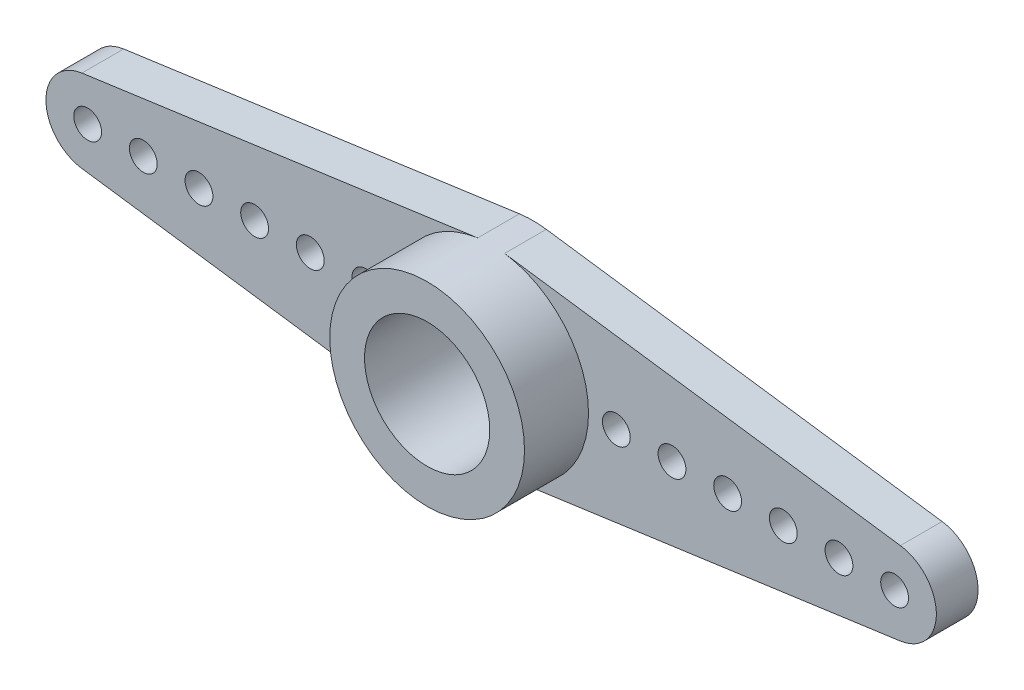
ISO-10303-21;
HEADER;
FILE_DESCRIPTION(('STEP AP214'),'2;1');
FILE_NAME('part.step','',(''),(''),'','','');
FILE_SCHEMA(('AUTOMOTIVE_DESIGN { 1 0 10303 214 1 1 1 1 }'));
ENDSEC;
DATA;
#1=APPLICATION_CONTEXT('core data for automotive mechanical design processes');
#2=APPLICATION_PROTOCOL_DEFINITION('international standard','automotive_design',2000,#1);
#3=PRODUCT_CONTEXT('',#1,'mechanical');
#4=PRODUCT('Part','Part','',(#3));
#5=PRODUCT_RELATED_PRODUCT_CATEGORY('part','',(#4));
#6=PRODUCT_DEFINITION_FORMATION('','',#4);
#7=PRODUCT_DEFINITION_CONTEXT('part definition',#1,'design');
#8=PRODUCT_DEFINITION('design','',#6,#7);
#9=PRODUCT_DEFINITION_SHAPE('','',#8);
#10=(LENGTH_UNIT() NAMED_UNIT(*) SI_UNIT(.MILLI.,.METRE.));
#11=(NAMED_UNIT(*) PLANE_ANGLE_UNIT() SI_UNIT($,.RADIAN.));
#12=(NAMED_UNIT(*) SI_UNIT($,.STERADIAN.) SOLID_ANGLE_UNIT());
#13=UNCERTAINTY_MEASURE_WITH_UNIT(LENGTH_MEASURE(1.E-05),#10,'distance_accuracy_value','');
#14=(GEOMETRIC_REPRESENTATION_CONTEXT(3) GLOBAL_UNCERTAINTY_ASSIGNED_CONTEXT((#13)) GLOBAL_UNIT_ASSIGNED_CONTEXT((#10,
#11,#12)) REPRESENTATION_CONTEXT('',''));
#15=CARTESIAN_POINT('',(0.,0.,0.));
#16=DIRECTION('',(0.,0.,1.));
#17=DIRECTION('',(1.,0.,0.));
#18=AXIS2_PLACEMENT_3D('',#15,#16,#17);
#19=CARTESIAN_POINT('',(-14.5,0.,1.5));
#20=DIRECTION('',(0.,0.,1.));
#21=DIRECTION('',(1.,0.,0.));
#22=AXIS2_PLACEMENT_3D('',#19,#20,#21);
#23=PLANE('',#22);
#24=CARTESIAN_POINT('',(-12.5,0.,1.5));
#25=DIRECTION('',(0.,0.,1.));
#26=DIRECTION('',(1.,0.,0.));
#27=AXIS2_PLACEMENT_3D('',#24,#25,#26);
#28=CIRCLE('',#27,0.499999999999999);
#29=CARTESIAN_POINT('',(-12.,0.,1.5));
#30=VERTEX_POINT('',#29);
#31=EDGE_CURVE('E452',#30,#30,#28,.F.);
#32=ORIENTED_EDGE('',*,*,#31,.T.);
#33=EDGE_LOOP('',(#32));
#34=FACE_BOUND('',#33,.T.);
#35=CARTESIAN_POINT('',(-14.5,0.,1.5));
#36=DIRECTION('',(0.,0.,1.));
#37=DIRECTION('',(1.,0.,0.));
#38=AXIS2_PLACEMENT_3D('',#35,#36,#37);
#39=CIRCLE('',#38,0.500000000000001);
#40=CARTESIAN_POINT('',(-14.,0.,1.5));
#41=VERTEX_POINT('',#40);
#42=EDGE_CURVE('E456',#41,#41,#39,.F.);
#43=ORIENTED_EDGE('',*,*,#42,.T.);
#44=EDGE_LOOP('',(#43));
#45=FACE_BOUND('',#44,.T.);
#46=CARTESIAN_POINT('',(-4.5,0.,1.5));
#47=DIRECTION('',(0.,0.,1.));
#48=DIRECTION('',(1.,0.,0.));
#49=AXIS2_PLACEMENT_3D('',#46,#47,#48);
#50=CIRCLE('',#49,0.5);
#51=CARTESIAN_POINT('',(-4.,0.,1.5));
#52=VERTEX_POINT('',#51);
#53=EDGE_CURVE('E480',#52,#52,#50,.F.);
#54=ORIENTED_EDGE('',*,*,#53,.T.);
#55=EDGE_LOOP('',(#54));
#56=FACE_BOUND('',#55,.T.);
#57=CARTESIAN_POINT('',(-10.5,0.,1.5));
#58=DIRECTION('',(0.,0.,1.));
#59=DIRECTION('',(1.,0.,0.));
#60=AXIS2_PLACEMENT_3D('',#57,#58,#59);
#61=CIRCLE('',#60,0.500000000000001);
#62=CARTESIAN_POINT('',(-10.,0.,1.5));
#63=VERTEX_POINT('',#62);
#64=EDGE_CURVE('E458',#63,#63,#61,.F.);
#65=ORIENTED_EDGE('',*,*,#64,.T.);
#66=EDGE_LOOP('',(#65));
#67=FACE_BOUND('',#66,.T.);
#68=CARTESIAN_POINT('',(-8.5,0.,1.5));
#69=DIRECTION('',(0.,0.,1.));
#70=DIRECTION('',(1.,0.,0.));
#71=AXIS2_PLACEMENT_3D('',#68,#69,#70);
#72=CIRCLE('',#71,0.500000000000001);
#73=CARTESIAN_POINT('',(-8.,0.,1.5));
#74=VERTEX_POINT('',#73);
#75=EDGE_CURVE('E500',#74,#74,#72,.F.);
#76=ORIENTED_EDGE('',*,*,#75,.T.);
#77=EDGE_LOOP('',(#76));
#78=FACE_BOUND('',#77,.T.);
#79=CARTESIAN_POINT('',(-6.5,0.,1.5));
#80=DIRECTION('',(0.,0.,1.));
#81=DIRECTION('',(1.,0.,0.));
#82=AXIS2_PLACEMENT_3D('',#79,#80,#81);
#83=CIRCLE('',#82,0.5);
#84=CARTESIAN_POINT('',(-6.,0.,1.5));
#85=VERTEX_POINT('',#84);
#86=EDGE_CURVE('E503',#85,#85,#83,.F.);
#87=ORIENTED_EDGE('',*,*,#86,.T.);
#88=EDGE_LOOP('',(#87));
#89=FACE_BOUND('',#88,.T.);
#90=CARTESIAN_POINT('',(0.,0.,1.5));
#91=DIRECTION('',(0.,0.,1.));
#92=DIRECTION('',(1.,0.,0.));
#93=AXIS2_PLACEMENT_3D('',#90,#91,#92);
#94=CIRCLE('',#93,3.5);
#95=CARTESIAN_POINT('',(-0.482758620689656,3.46654642463502,1.5));
#96=VERTEX_POINT('',#95);
#97=CARTESIAN_POINT('',(-0.482758620689655,-3.46654642463502,1.5));
#98=VERTEX_POINT('',#97);
#99=EDGE_CURVE('E11',#96,#98,#94,.T.);
#100=ORIENTED_EDGE('',*,*,#99,.F.);
#101=DIRECTION('',(-0.990441835610005,-0.137931034482759,0.));
#102=VECTOR('',#101,1.);
#103=CARTESIAN_POINT('',(-14.7068965517241,1.48566275341501,1.5));
#104=LINE('',#103,#102);
#105=CARTESIAN_POINT('',(-14.7068965517241,1.48566275341501,1.5));
#106=VERTEX_POINT('',#105);
#107=EDGE_CURVE('E56',#96,#106,#104,.T.);
#108=ORIENTED_EDGE('',*,*,#107,.T.);
#109=CARTESIAN_POINT('',(-14.5,0.,1.5));
#110=DIRECTION('',(0.,0.,1.));
#111=DIRECTION('',(1.,0.,0.));
#112=AXIS2_PLACEMENT_3D('',#109,#110,#111);
#113=CIRCLE('',#112,1.5);
#114=CARTESIAN_POINT('',(-14.7068965517241,-1.48566275341501,1.5));
#115=VERTEX_POINT('',#114);
#116=EDGE_CURVE('E158',#106,#115,#113,.T.);
#117=ORIENTED_EDGE('',*,*,#116,.T.);
#118=DIRECTION('',(0.990441835610005,-0.137931034482759,0.));
#119=VECTOR('',#118,1.);
#120=CARTESIAN_POINT('',(-14.7068965517241,-1.48566275341501,1.5));
#121=LINE('',#120,#119);
#122=EDGE_CURVE('E101',#115,#98,#121,.T.);
#123=ORIENTED_EDGE('',*,*,#122,.T.);
#124=EDGE_LOOP('',(#100,#108,#117,#123));
#125=FACE_BOUND('',#124,.T.);
#126=ADVANCED_FACE('F37',(#34,#45,#56,#67,#78,#89,#125),#23,.T.);
#127=CARTESIAN_POINT('',(-14.5,0.,1.5));
#128=DIRECTION('',(0.,0.,-1.));
#129=DIRECTION('',(-1.,0.,0.));
#130=AXIS2_PLACEMENT_3D('',#127,#128,#129);
#131=CYLINDRICAL_SURFACE('',#130,1.5);
#132=CARTESIAN_POINT('',(-14.5,0.,0.));
#133=DIRECTION('',(0.,0.,1.));
#134=DIRECTION('',(1.,0.,0.));
#135=AXIS2_PLACEMENT_3D('',#132,#133,#134);
#136=CIRCLE('',#135,1.5);
#137=CARTESIAN_POINT('',(-14.7068965517241,1.48566275341501,0.));
#138=VERTEX_POINT('',#137);
#139=CARTESIAN_POINT('',(-14.7068965517241,-1.48566275341501,0.));
#140=VERTEX_POINT('',#139);
#141=EDGE_CURVE('E143',#138,#140,#136,.T.);
#142=ORIENTED_EDGE('',*,*,#141,.T.);
#143=DIRECTION('',(0.,0.,-1.));
#144=VECTOR('',#143,1.);
#145=CARTESIAN_POINT('',(-14.7068965517241,-1.48566275341501,1.5));
#146=LINE('',#145,#144);
#147=EDGE_CURVE('E41',#115,#140,#146,.T.);
#148=ORIENTED_EDGE('',*,*,#147,.F.);
#149=ORIENTED_EDGE('',*,*,#116,.F.);
#150=DIRECTION('',(0.,0.,-1.));
#151=VECTOR('',#150,1.);
#152=CARTESIAN_POINT('',(-14.7068965517241,1.48566275341501,1.5));
#153=LINE('',#152,#151);
#154=EDGE_CURVE('E139',#106,#138,#153,.T.);
#155=ORIENTED_EDGE('',*,*,#154,.T.);
#156=EDGE_LOOP('',(#142,#148,#149,#155));
#157=FACE_BOUND('',#156,.T.);
#158=ADVANCED_FACE('F39',(#157),#131,.T.);
#159=CARTESIAN_POINT('',(-14.7068965517241,-1.48566275341501,1.5));
#160=DIRECTION('',(0.137931034482759,0.990441835610005,0.));
#161=DIRECTION('',(-0.990441835610005,0.137931034482759,0.));
#162=AXIS2_PLACEMENT_3D('',#159,#160,#161);
#163=PLANE('',#162);
#164=DIRECTION('',(0.990441835610005,-0.137931034482759,0.));
#165=VECTOR('',#164,1.);
#166=CARTESIAN_POINT('',(-14.7068965517241,-1.48566275341501,0.));
#167=LINE('',#166,#165);
#168=CARTESIAN_POINT('',(-0.482758620689655,-3.46654642463502,0.));
#169=VERTEX_POINT('',#168);
#170=EDGE_CURVE('E146',#140,#169,#167,.T.);
#171=ORIENTED_EDGE('',*,*,#170,.T.);
#172=DIRECTION('',(0.,0.,-1.));
#173=VECTOR('',#172,1.);
#174=CARTESIAN_POINT('',(-0.482758620689655,-3.46654642463502,1.5));
#175=LINE('',#174,#173);
#176=EDGE_CURVE('E166',#98,#169,#175,.T.);
#177=ORIENTED_EDGE('',*,*,#176,.F.);
#178=ORIENTED_EDGE('',*,*,#122,.F.);
#179=ORIENTED_EDGE('',*,*,#147,.T.);
#180=EDGE_LOOP('',(#171,#177,#178,#179));
#181=FACE_BOUND('',#180,.T.);
#182=ADVANCED_FACE('F176',(#181),#163,.F.);
#183=CARTESIAN_POINT('',(14.7068965517241,-1.48566275341501,1.5));
#184=DIRECTION('',(-0.137931034482759,0.990441835610005,0.));
#185=DIRECTION('',(-0.990441835610005,-0.137931034482759,0.));
#186=AXIS2_PLACEMENT_3D('',#183,#184,#185);
#187=PLANE('',#186);
#188=DIRECTION('',(0.990441835610005,0.137931034482759,0.));
#189=VECTOR('',#188,1.);
#190=CARTESIAN_POINT('',(14.7068965517241,-1.48566275341501,0.));
#191=LINE('',#190,#189);
#192=CARTESIAN_POINT('',(0.482758620689655,-3.46654642463502,0.));
#193=VERTEX_POINT('',#192);
#194=CARTESIAN_POINT('',(14.7068965517241,-1.48566275341501,0.));
#195=VERTEX_POINT('',#194);
#196=EDGE_CURVE('E151',#193,#195,#191,.T.);
#197=ORIENTED_EDGE('',*,*,#196,.T.);
#198=DIRECTION('',(0.,0.,-1.));
#199=VECTOR('',#198,1.);
#200=CARTESIAN_POINT('',(14.7068965517241,-1.48566275341501,1.5));
#201=LINE('',#200,#199);
#202=CARTESIAN_POINT('',(14.7068965517241,-1.48566275341501,1.5));
#203=VERTEX_POINT('',#202);
#204=EDGE_CURVE('E133',#203,#195,#201,.T.);
#205=ORIENTED_EDGE('',*,*,#204,.F.);
#206=DIRECTION('',(0.990441835610005,0.137931034482759,0.));
#207=VECTOR('',#206,1.);
#208=CARTESIAN_POINT('',(14.7068965517241,-1.48566275341501,1.5));
#209=LINE('',#208,#207);
#210=CARTESIAN_POINT('',(0.482758620689655,-3.46654642463502,1.5));
#211=VERTEX_POINT('',#210);
#212=EDGE_CURVE('E121',#211,#203,#209,.T.);
#213=ORIENTED_EDGE('',*,*,#212,.F.);
#214=DIRECTION('',(0.,0.,-1.));
#215=VECTOR('',#214,1.);
#216=CARTESIAN_POINT('',(0.482758620689655,-3.46654642463502,1.5));
#217=LINE('',#216,#215);
#218=EDGE_CURVE('E164',#211,#193,#217,.T.);
#219=ORIENTED_EDGE('',*,*,#218,.T.);
#220=EDGE_LOOP('',(#197,#205,#213,#219));
#221=FACE_BOUND('',#220,.T.);
#222=ADVANCED_FACE('F186',(#221),#187,.F.);
#223=CARTESIAN_POINT('',(14.5,0.,1.5));
#224=DIRECTION('',(0.,0.,-1.));
#225=DIRECTION('',(-1.,0.,0.));
#226=AXIS2_PLACEMENT_3D('',#223,#224,#225);
#227=CYLINDRICAL_SURFACE('',#226,1.5);
#228=CARTESIAN_POINT('',(14.5,0.,0.));
#229=DIRECTION('',(0.,0.,1.));
#230=DIRECTION('',(-1.,0.,0.));
#231=AXIS2_PLACEMENT_3D('',#228,#229,#230);
#232=CIRCLE('',#231,1.5);
#233=CARTESIAN_POINT('',(14.7068965517241,1.48566275341501,0.));
#234=VERTEX_POINT('',#233);
#235=EDGE_CURVE('E130',#195,#234,#232,.T.);
#236=ORIENTED_EDGE('',*,*,#235,.T.);
#237=DIRECTION('',(0.,0.,-1.));
#238=VECTOR('',#237,1.);
#239=CARTESIAN_POINT('',(14.7068965517241,1.48566275341501,1.5));
#240=LINE('',#239,#238);
#241=CARTESIAN_POINT('',(14.7068965517241,1.48566275341501,1.5));
#242=VERTEX_POINT('',#241);
#243=EDGE_CURVE('E127',#242,#234,#240,.T.);
#244=ORIENTED_EDGE('',*,*,#243,.F.);
#245=CARTESIAN_POINT('',(14.5,0.,1.5));
#246=DIRECTION('',(0.,0.,1.));
#247=DIRECTION('',(-1.,0.,0.));
#248=AXIS2_PLACEMENT_3D('',#245,#246,#247);
#249=CIRCLE('',#248,1.5);
#250=EDGE_CURVE('E114',#203,#242,#249,.T.);
#251=ORIENTED_EDGE('',*,*,#250,.F.);
#252=ORIENTED_EDGE('',*,*,#204,.T.);
#253=EDGE_LOOP('',(#236,#244,#251,#252));
#254=FACE_BOUND('',#253,.T.);
#255=ADVANCED_FACE('F128',(#254),#227,.T.);
#256=CARTESIAN_POINT('',(14.7068965517241,1.48566275341501,1.5));
#257=DIRECTION('',(-0.137931034482759,-0.990441835610005,0.));
#258=DIRECTION('',(0.990441835610005,-0.137931034482759,0.));
#259=AXIS2_PLACEMENT_3D('',#256,#257,#258);
#260=PLANE('',#259);
#261=DIRECTION('',(-0.990441835610005,0.137931034482759,0.));
#262=VECTOR('',#261,1.);
#263=CARTESIAN_POINT('',(14.7068965517241,1.48566275341501,0.));
#264=LINE('',#263,#262);
#265=CARTESIAN_POINT('',(0.482758620689655,3.46654642463502,0.));
#266=VERTEX_POINT('',#265);
#267=EDGE_CURVE('E154',#234,#266,#264,.T.);
#268=ORIENTED_EDGE('',*,*,#267,.T.);
#269=DIRECTION('',(0.,0.,-1.));
#270=VECTOR('',#269,1.);
#271=CARTESIAN_POINT('',(0.482758620689655,3.46654642463502,1.5));
#272=LINE('',#271,#270);
#273=CARTESIAN_POINT('',(0.482758620689655,3.46654642463502,1.5));
#274=VERTEX_POINT('',#273);
#275=EDGE_CURVE('E134',#274,#266,#272,.T.);
#276=ORIENTED_EDGE('',*,*,#275,.F.);
#277=DIRECTION('',(-0.990441835610005,0.137931034482759,0.));
#278=VECTOR('',#277,1.);
#279=CARTESIAN_POINT('',(14.7068965517241,1.48566275341501,1.5));
#280=LINE('',#279,#278);
#281=EDGE_CURVE('E118',#242,#274,#280,.T.);
#282=ORIENTED_EDGE('',*,*,#281,.F.);
#283=ORIENTED_EDGE('',*,*,#243,.T.);
#284=EDGE_LOOP('',(#268,#276,#282,#283));
#285=FACE_BOUND('',#284,.T.);
#286=ADVANCED_FACE('F137',(#285),#260,.F.);
#287=CARTESIAN_POINT('',(0.,0.,1.5));
#288=DIRECTION('',(0.,0.,-1.));
#289=DIRECTION('',(-1.,0.,0.));
#290=AXIS2_PLACEMENT_3D('',#287,#288,#289);
#291=CYLINDRICAL_SURFACE('',#290,3.5);
#292=CARTESIAN_POINT('',(0.,0.,0.));
#293=DIRECTION('',(0.,0.,1.));
#294=DIRECTION('',(1.,0.,0.));
#295=AXIS2_PLACEMENT_3D('',#292,#293,#294);
#296=CIRCLE('',#295,3.5);
#297=CARTESIAN_POINT('',(-0.482758620689656,3.46654642463502,0.));
#298=VERTEX_POINT('',#297);
#299=EDGE_CURVE('E86',#266,#298,#296,.T.);
#300=ORIENTED_EDGE('',*,*,#299,.T.);
#301=DIRECTION('',(0.,0.,-1.));
#302=VECTOR('',#301,1.);
#303=CARTESIAN_POINT('',(-0.482758620689656,3.46654642463502,1.5));
#304=LINE('',#303,#302);
#305=EDGE_CURVE('E160',#96,#298,#304,.T.);
#306=ORIENTED_EDGE('',*,*,#305,.F.);
#307=ORIENTED_EDGE('',*,*,#99,.T.);
#308=ORIENTED_EDGE('',*,*,#176,.T.);
#309=CARTESIAN_POINT('',(0.,0.,0.));
#310=DIRECTION('',(0.,0.,1.));
#311=DIRECTION('',(1.,0.,0.));
#312=AXIS2_PLACEMENT_3D('',#309,#310,#311);
#313=CIRCLE('',#312,3.5);
#314=EDGE_CURVE('E149',#169,#193,#313,.T.);
#315=ORIENTED_EDGE('',*,*,#314,.T.);
#316=ORIENTED_EDGE('',*,*,#218,.F.);
#317=EDGE_CURVE('E47',#211,#274,#94,.T.);
#318=ORIENTED_EDGE('',*,*,#317,.T.);
#319=ORIENTED_EDGE('',*,*,#275,.T.);
#320=EDGE_LOOP('',(#300,#306,#307,#308,#315,#316,#318,#319));
#321=FACE_BOUND('',#320,.T.);
#322=CARTESIAN_POINT('',(0.,0.,3.8));
#323=DIRECTION('',(0.,0.,1.));
#324=DIRECTION('',(1.,0.,0.));
#325=AXIS2_PLACEMENT_3D('',#322,#323,#324);
#326=CIRCLE('',#325,3.5);
#327=CARTESIAN_POINT('',(3.5,0.,3.8));
#328=VERTEX_POINT('',#327);
#329=EDGE_CURVE('E147',#328,#328,#326,.T.);
#330=ORIENTED_EDGE('',*,*,#329,.F.);
#331=EDGE_LOOP('',(#330));
#332=FACE_BOUND('',#331,.T.);
#333=ADVANCED_FACE('F177',(#321,#332),#291,.T.);
#334=CARTESIAN_POINT('',(-14.7068965517241,1.48566275341501,1.5));
#335=DIRECTION('',(0.137931034482759,-0.990441835610005,0.));
#336=DIRECTION('',(0.990441835610005,0.137931034482759,0.));
#337=AXIS2_PLACEMENT_3D('',#334,#335,#336);
#338=PLANE('',#337);
#339=DIRECTION('',(-0.990441835610005,-0.137931034482759,0.));
#340=VECTOR('',#339,1.);
#341=CARTESIAN_POINT('',(-14.7068965517241,1.48566275341501,0.));
#342=LINE('',#341,#340);
#343=EDGE_CURVE('E92',#298,#138,#342,.T.);
#344=ORIENTED_EDGE('',*,*,#343,.T.);
#345=ORIENTED_EDGE('',*,*,#154,.F.);
#346=ORIENTED_EDGE('',*,*,#107,.F.);
#347=ORIENTED_EDGE('',*,*,#305,.T.);
#348=EDGE_LOOP('',(#344,#345,#346,#347));
#349=FACE_BOUND('',#348,.T.);
#350=ADVANCED_FACE('F179',(#349),#338,.F.);
#351=CARTESIAN_POINT('',(14.5,0.,1.5));
#352=DIRECTION('',(0.,0.,1.));
#353=DIRECTION('',(1.,0.,0.));
#354=AXIS2_PLACEMENT_3D('',#351,#352,#353);
#355=CIRCLE('',#354,0.500000000000001);
#356=CARTESIAN_POINT('',(15.,0.,1.5));
#357=VERTEX_POINT('',#356);
#358=EDGE_CURVE('E216',#357,#357,#355,.F.);
#359=ORIENTED_EDGE('',*,*,#358,.T.);
#360=EDGE_LOOP('',(#359));
#361=FACE_BOUND('',#360,.T.);
#362=CARTESIAN_POINT('',(12.5,0.,1.5));
#363=DIRECTION('',(0.,0.,1.));
#364=DIRECTION('',(1.,0.,0.));
#365=AXIS2_PLACEMENT_3D('',#362,#363,#364);
#366=CIRCLE('',#365,0.499999999999999);
#367=CARTESIAN_POINT('',(13.,0.,1.5));
#368=VERTEX_POINT('',#367);
#369=EDGE_CURVE('E220',#368,#368,#366,.F.);
#370=ORIENTED_EDGE('',*,*,#369,.T.);
#371=EDGE_LOOP('',(#370));
#372=FACE_BOUND('',#371,.T.);
#373=CARTESIAN_POINT('',(10.5,0.,1.5));
#374=DIRECTION('',(0.,0.,1.));
#375=DIRECTION('',(1.,0.,0.));
#376=AXIS2_PLACEMENT_3D('',#373,#374,#375);
#377=CIRCLE('',#376,0.500000000000001);
#378=CARTESIAN_POINT('',(11.,0.,1.5));
#379=VERTEX_POINT('',#378);
#380=EDGE_CURVE('E224',#379,#379,#377,.F.);
#381=ORIENTED_EDGE('',*,*,#380,.T.);
#382=EDGE_LOOP('',(#381));
#383=FACE_BOUND('',#382,.T.);
#384=CARTESIAN_POINT('',(8.5,0.,1.5));
#385=DIRECTION('',(0.,0.,1.));
#386=DIRECTION('',(1.,0.,0.));
#387=AXIS2_PLACEMENT_3D('',#384,#385,#386);
#388=CIRCLE('',#387,0.500000000000001);
#389=CARTESIAN_POINT('',(9.,0.,1.5));
#390=VERTEX_POINT('',#389);
#391=EDGE_CURVE('E228',#390,#390,#388,.F.);
#392=ORIENTED_EDGE('',*,*,#391,.T.);
#393=EDGE_LOOP('',(#392));
#394=FACE_BOUND('',#393,.T.);
#395=CARTESIAN_POINT('',(6.5,0.,1.5));
#396=DIRECTION('',(0.,0.,1.));
#397=DIRECTION('',(1.,0.,0.));
#398=AXIS2_PLACEMENT_3D('',#395,#396,#397);
#399=CIRCLE('',#398,0.5);
#400=CARTESIAN_POINT('',(7.,0.,1.5));
#401=VERTEX_POINT('',#400);
#402=EDGE_CURVE('E232',#401,#401,#399,.F.);
#403=ORIENTED_EDGE('',*,*,#402,.T.);
#404=EDGE_LOOP('',(#403));
#405=FACE_BOUND('',#404,.T.);
#406=CARTESIAN_POINT('',(4.5,0.,1.5));
#407=DIRECTION('',(0.,0.,1.));
#408=DIRECTION('',(1.,0.,0.));
#409=AXIS2_PLACEMENT_3D('',#406,#407,#408);
#410=CIRCLE('',#409,0.5);
#411=CARTESIAN_POINT('',(5.,0.,1.5));
#412=VERTEX_POINT('',#411);
#413=EDGE_CURVE('E235',#412,#412,#410,.F.);
#414=ORIENTED_EDGE('',*,*,#413,.T.);
#415=EDGE_LOOP('',(#414));
#416=FACE_BOUND('',#415,.T.);
#417=ORIENTED_EDGE('',*,*,#317,.F.);
#418=ORIENTED_EDGE('',*,*,#212,.T.);
#419=ORIENTED_EDGE('',*,*,#250,.T.);
#420=ORIENTED_EDGE('',*,*,#281,.T.);
#421=EDGE_LOOP('',(#417,#418,#419,#420));
#422=FACE_BOUND('',#421,.T.);
#423=ADVANCED_FACE('F116',(#361,#372,#383,#394,#405,#416,#422),#23,.T.);
#424=CARTESIAN_POINT('',(-14.5,0.,0.));
#425=DIRECTION('',(0.,0.,1.));
#426=DIRECTION('',(1.,0.,0.));
#427=AXIS2_PLACEMENT_3D('',#424,#425,#426);
#428=PLANE('',#427);
#429=CARTESIAN_POINT('',(-12.5,0.,0.));
#430=DIRECTION('',(0.,0.,-1.));
#431=DIRECTION('',(1.,0.,0.));
#432=AXIS2_PLACEMENT_3D('',#429,#430,#431);
#433=CIRCLE('',#432,0.499999999999999);
#434=CARTESIAN_POINT('',(-12.,0.,0.));
#435=VERTEX_POINT('',#434);
#436=EDGE_CURVE('E450',#435,#435,#433,.T.);
#437=ORIENTED_EDGE('',*,*,#436,.F.);
#438=EDGE_LOOP('',(#437));
#439=FACE_BOUND('',#438,.T.);
#440=CARTESIAN_POINT('',(-14.5,0.,0.));
#441=DIRECTION('',(0.,0.,-1.));
#442=DIRECTION('',(1.,0.,0.));
#443=AXIS2_PLACEMENT_3D('',#440,#441,#442);
#444=CIRCLE('',#443,0.500000000000001);
#445=CARTESIAN_POINT('',(-14.,0.,0.));
#446=VERTEX_POINT('',#445);
#447=EDGE_CURVE('E453',#446,#446,#444,.T.);
#448=ORIENTED_EDGE('',*,*,#447,.F.);
#449=EDGE_LOOP('',(#448));
#450=FACE_BOUND('',#449,.T.);
#451=CARTESIAN_POINT('',(-4.5,0.,0.));
#452=DIRECTION('',(0.,0.,-1.));
#453=DIRECTION('',(1.,0.,0.));
#454=AXIS2_PLACEMENT_3D('',#451,#452,#453);
#455=CIRCLE('',#454,0.5);
#456=CARTESIAN_POINT('',(-4.,0.,0.));
#457=VERTEX_POINT('',#456);
#458=EDGE_CURVE('E484',#457,#457,#455,.T.);
#459=ORIENTED_EDGE('',*,*,#458,.F.);
#460=EDGE_LOOP('',(#459));
#461=FACE_BOUND('',#460,.T.);
#462=CARTESIAN_POINT('',(14.5,0.,0.));
#463=DIRECTION('',(0.,0.,-1.));
#464=DIRECTION('',(-1.,0.,0.));
#465=AXIS2_PLACEMENT_3D('',#462,#463,#464);
#466=CIRCLE('',#465,0.500000000000001);
#467=CARTESIAN_POINT('',(14.,0.,0.));
#468=VERTEX_POINT('',#467);
#469=EDGE_CURVE('E477',#468,#468,#466,.T.);
#470=ORIENTED_EDGE('',*,*,#469,.F.);
#471=EDGE_LOOP('',(#470));
#472=FACE_BOUND('',#471,.T.);
#473=CARTESIAN_POINT('',(12.5,0.,0.));
#474=DIRECTION('',(0.,0.,-1.));
#475=DIRECTION('',(-1.,0.,0.));
#476=AXIS2_PLACEMENT_3D('',#473,#474,#475);
#477=CIRCLE('',#476,0.499999999999999);
#478=CARTESIAN_POINT('',(12.,0.,0.));
#479=VERTEX_POINT('',#478);
#480=EDGE_CURVE('E474',#479,#479,#477,.T.);
#481=ORIENTED_EDGE('',*,*,#480,.F.);
#482=EDGE_LOOP('',(#481));
#483=FACE_BOUND('',#482,.T.);
#484=CARTESIAN_POINT('',(10.5,0.,0.));
#485=DIRECTION('',(0.,0.,-1.));
#486=DIRECTION('',(-1.,0.,0.));
#487=AXIS2_PLACEMENT_3D('',#484,#485,#486);
#488=CIRCLE('',#487,0.500000000000001);
#489=CARTESIAN_POINT('',(10.,0.,0.));
#490=VERTEX_POINT('',#489);
#491=EDGE_CURVE('E470',#490,#490,#488,.T.);
#492=ORIENTED_EDGE('',*,*,#491,.F.);
#493=EDGE_LOOP('',(#492));
#494=FACE_BOUND('',#493,.T.);
#495=CARTESIAN_POINT('',(8.5,0.,0.));
#496=DIRECTION('',(0.,0.,-1.));
#497=DIRECTION('',(-1.,0.,0.));
#498=AXIS2_PLACEMENT_3D('',#495,#496,#497);
#499=CIRCLE('',#498,0.500000000000001);
#500=CARTESIAN_POINT('',(8.,0.,0.));
#501=VERTEX_POINT('',#500);
#502=EDGE_CURVE('E466',#501,#501,#499,.T.);
#503=ORIENTED_EDGE('',*,*,#502,.F.);
#504=EDGE_LOOP('',(#503));
#505=FACE_BOUND('',#504,.T.);
#506=CARTESIAN_POINT('',(6.5,0.,0.));
#507=DIRECTION('',(0.,0.,-1.));
#508=DIRECTION('',(-1.,0.,0.));
#509=AXIS2_PLACEMENT_3D('',#506,#507,#508);
#510=CIRCLE('',#509,0.5);
#511=CARTESIAN_POINT('',(6.,0.,0.));
#512=VERTEX_POINT('',#511);
#513=EDGE_CURVE('E462',#512,#512,#510,.T.);
#514=ORIENTED_EDGE('',*,*,#513,.F.);
#515=EDGE_LOOP('',(#514));
#516=FACE_BOUND('',#515,.T.);
#517=CARTESIAN_POINT('',(-10.5,0.,0.));
#518=DIRECTION('',(0.,0.,-1.));
#519=DIRECTION('',(1.,0.,0.));
#520=AXIS2_PLACEMENT_3D('',#517,#518,#519);
#521=CIRCLE('',#520,0.500000000000001);
#522=CARTESIAN_POINT('',(-10.,0.,0.));
#523=VERTEX_POINT('',#522);
#524=EDGE_CURVE('E512',#523,#523,#521,.T.);
#525=ORIENTED_EDGE('',*,*,#524,.F.);
#526=EDGE_LOOP('',(#525));
#527=FACE_BOUND('',#526,.T.);
#528=CARTESIAN_POINT('',(-8.5,0.,0.));
#529=DIRECTION('',(0.,0.,-1.));
#530=DIRECTION('',(1.,0.,0.));
#531=AXIS2_PLACEMENT_3D('',#528,#529,#530);
#532=CIRCLE('',#531,0.500000000000001);
#533=CARTESIAN_POINT('',(-8.,0.,0.));
#534=VERTEX_POINT('',#533);
#535=EDGE_CURVE('E505',#534,#534,#532,.T.);
#536=ORIENTED_EDGE('',*,*,#535,.F.);
#537=EDGE_LOOP('',(#536));
#538=FACE_BOUND('',#537,.T.);
#539=CARTESIAN_POINT('',(-6.5,0.,0.));
#540=DIRECTION('',(0.,0.,-1.));
#541=DIRECTION('',(1.,0.,0.));
#542=AXIS2_PLACEMENT_3D('',#539,#540,#541);
#543=CIRCLE('',#542,0.5);
#544=CARTESIAN_POINT('',(-6.,0.,0.));
#545=VERTEX_POINT('',#544);
#546=EDGE_CURVE('E506',#545,#545,#543,.T.);
#547=ORIENTED_EDGE('',*,*,#546,.F.);
#548=EDGE_LOOP('',(#547));
#549=FACE_BOUND('',#548,.T.);
#550=CARTESIAN_POINT('',(4.5,0.,0.));
#551=DIRECTION('',(0.,0.,-1.));
#552=DIRECTION('',(-1.,0.,0.));
#553=AXIS2_PLACEMENT_3D('',#550,#551,#552);
#554=CIRCLE('',#553,0.5);
#555=CARTESIAN_POINT('',(4.,0.,0.));
#556=VERTEX_POINT('',#555);
#557=EDGE_CURVE('E238',#556,#556,#554,.T.);
#558=ORIENTED_EDGE('',*,*,#557,.F.);
#559=EDGE_LOOP('',(#558));
#560=FACE_BOUND('',#559,.T.);
#561=CARTESIAN_POINT('',(0.,0.,0.));
#562=DIRECTION('',(0.,0.,1.));
#563=DIRECTION('',(1.,0.,0.));
#564=AXIS2_PLACEMENT_3D('',#561,#562,#563);
#565=CIRCLE('',#564,2.25);
#566=CARTESIAN_POINT('',(2.25,0.,0.));
#567=VERTEX_POINT('',#566);
#568=EDGE_CURVE('E241',#567,#567,#565,.F.);
#569=ORIENTED_EDGE('',*,*,#568,.F.);
#570=EDGE_LOOP('',(#569));
#571=FACE_BOUND('',#570,.T.);
#572=ORIENTED_EDGE('',*,*,#141,.F.);
#573=ORIENTED_EDGE('',*,*,#343,.F.);
#574=ORIENTED_EDGE('',*,*,#299,.F.);
#575=ORIENTED_EDGE('',*,*,#267,.F.);
#576=ORIENTED_EDGE('',*,*,#235,.F.);
#577=ORIENTED_EDGE('',*,*,#196,.F.);
#578=ORIENTED_EDGE('',*,*,#314,.F.);
#579=ORIENTED_EDGE('',*,*,#170,.F.);
#580=EDGE_LOOP('',(#572,#573,#574,#575,#576,#577,#578,#579));
#581=FACE_BOUND('',#580,.T.);
#582=ADVANCED_FACE('F183',(#439,#450,#461,#472,#483,#494,#505,#516,#527,#538,#549,#560,#571,
#581),#428,.F.);
#583=CARTESIAN_POINT('',(0.,0.,3.8));
#584=DIRECTION('',(0.,0.,1.));
#585=DIRECTION('',(1.,0.,0.));
#586=AXIS2_PLACEMENT_3D('',#583,#584,#585);
#587=PLANE('',#586);
#588=CARTESIAN_POINT('',(0.,0.,3.8));
#589=DIRECTION('',(0.,0.,1.));
#590=DIRECTION('',(1.,0.,0.));
#591=AXIS2_PLACEMENT_3D('',#588,#589,#590);
#592=CIRCLE('',#591,2.25);
#593=CARTESIAN_POINT('',(2.25,0.,3.8));
#594=VERTEX_POINT('',#593);
#595=EDGE_CURVE('E237',#594,#594,#592,.T.);
#596=ORIENTED_EDGE('',*,*,#595,.F.);
#597=EDGE_LOOP('',(#596));
#598=FACE_BOUND('',#597,.T.);
#599=ORIENTED_EDGE('',*,*,#329,.T.);
#600=EDGE_LOOP('',(#599));
#601=FACE_BOUND('',#600,.T.);
#602=ADVANCED_FACE('F210',(#598,#601),#587,.T.);
#603=CARTESIAN_POINT('',(0.,0.,-6.36396103067893));
#604=DIRECTION('',(0.,0.,1.));
#605=DIRECTION('',(1.,0.,0.));
#606=AXIS2_PLACEMENT_3D('',#603,#604,#605);
#607=CYLINDRICAL_SURFACE('',#606,2.25);
#608=ORIENTED_EDGE('',*,*,#568,.T.);
#609=EDGE_LOOP('',(#608));
#610=FACE_BOUND('',#609,.T.);
#611=ORIENTED_EDGE('',*,*,#595,.T.);
#612=EDGE_LOOP('',(#611));
#613=FACE_BOUND('',#612,.T.);
#614=ADVANCED_FACE('F302',(#610,#613),#607,.F.);
#615=CARTESIAN_POINT('',(4.5,0.,2.9142135623731));
#616=DIRECTION('',(0.,0.,-1.));
#617=DIRECTION('',(-1.,0.,0.));
#618=AXIS2_PLACEMENT_3D('',#615,#616,#617);
#619=CYLINDRICAL_SURFACE('',#618,0.5);
#620=ORIENTED_EDGE('',*,*,#557,.T.);
#621=EDGE_LOOP('',(#620));
#622=FACE_BOUND('',#621,.T.);
#623=ORIENTED_EDGE('',*,*,#413,.F.);
#624=EDGE_LOOP('',(#623));
#625=FACE_BOUND('',#624,.T.);
#626=ADVANCED_FACE('F310',(#622,#625),#619,.F.);
#627=CARTESIAN_POINT('',(-6.5,0.,2.9142135623731));
#628=DIRECTION('',(0.,0.,-1.));
#629=DIRECTION('',(-1.,0.,0.));
#630=AXIS2_PLACEMENT_3D('',#627,#628,#629);
#631=CYLINDRICAL_SURFACE('',#630,0.5);
#632=ORIENTED_EDGE('',*,*,#546,.T.);
#633=EDGE_LOOP('',(#632));
#634=FACE_BOUND('',#633,.T.);
#635=ORIENTED_EDGE('',*,*,#86,.F.);
#636=EDGE_LOOP('',(#635));
#637=FACE_BOUND('',#636,.T.);
#638=ADVANCED_FACE('F333',(#634,#637),#631,.F.);
#639=CARTESIAN_POINT('',(-8.5,0.,2.9142135623731));
#640=DIRECTION('',(0.,0.,-1.));
#641=DIRECTION('',(-1.,0.,0.));
#642=AXIS2_PLACEMENT_3D('',#639,#640,#641);
#643=CYLINDRICAL_SURFACE('',#642,0.500000000000001);
#644=ORIENTED_EDGE('',*,*,#535,.T.);
#645=EDGE_LOOP('',(#644));
#646=FACE_BOUND('',#645,.T.);
#647=ORIENTED_EDGE('',*,*,#75,.F.);
#648=EDGE_LOOP('',(#647));
#649=FACE_BOUND('',#648,.T.);
#650=ADVANCED_FACE('F343',(#646,#649),#643,.F.);
#651=CARTESIAN_POINT('',(-10.5,0.,2.9142135623731));
#652=DIRECTION('',(0.,0.,-1.));
#653=DIRECTION('',(-1.,0.,0.));
#654=AXIS2_PLACEMENT_3D('',#651,#652,#653);
#655=CYLINDRICAL_SURFACE('',#654,0.500000000000001);
#656=ORIENTED_EDGE('',*,*,#524,.T.);
#657=EDGE_LOOP('',(#656));
#658=FACE_BOUND('',#657,.T.);
#659=ORIENTED_EDGE('',*,*,#64,.F.);
#660=EDGE_LOOP('',(#659));
#661=FACE_BOUND('',#660,.T.);
#662=ADVANCED_FACE('F353',(#658,#661),#655,.F.);
#663=CARTESIAN_POINT('',(6.5,0.,2.9142135623731));
#664=DIRECTION('',(0.,0.,-1.));
#665=DIRECTION('',(-1.,0.,0.));
#666=AXIS2_PLACEMENT_3D('',#663,#664,#665);
#667=CYLINDRICAL_SURFACE('',#666,0.5);
#668=ORIENTED_EDGE('',*,*,#513,.T.);
#669=EDGE_LOOP('',(#668));
#670=FACE_BOUND('',#669,.T.);
#671=ORIENTED_EDGE('',*,*,#402,.F.);
#672=EDGE_LOOP('',(#671));
#673=FACE_BOUND('',#672,.T.);
#674=ADVANCED_FACE('F363',(#670,#673),#667,.F.);
#675=CARTESIAN_POINT('',(8.5,0.,2.9142135623731));
#676=DIRECTION('',(0.,0.,-1.));
#677=DIRECTION('',(-1.,0.,0.));
#678=AXIS2_PLACEMENT_3D('',#675,#676,#677);
#679=CYLINDRICAL_SURFACE('',#678,0.500000000000001);
#680=ORIENTED_EDGE('',*,*,#502,.T.);
#681=EDGE_LOOP('',(#680));
#682=FACE_BOUND('',#681,.T.);
#683=ORIENTED_EDGE('',*,*,#391,.F.);
#684=EDGE_LOOP('',(#683));
#685=FACE_BOUND('',#684,.T.);
#686=ADVANCED_FACE('F373',(#682,#685),#679,.F.);
#687=CARTESIAN_POINT('',(10.5,0.,2.9142135623731));
#688=DIRECTION('',(0.,0.,-1.));
#689=DIRECTION('',(-1.,0.,0.));
#690=AXIS2_PLACEMENT_3D('',#687,#688,#689);
#691=CYLINDRICAL_SURFACE('',#690,0.500000000000001);
#692=ORIENTED_EDGE('',*,*,#491,.T.);
#693=EDGE_LOOP('',(#692));
#694=FACE_BOUND('',#693,.T.);
#695=ORIENTED_EDGE('',*,*,#380,.F.);
#696=EDGE_LOOP('',(#695));
#697=FACE_BOUND('',#696,.T.);
#698=ADVANCED_FACE('F383',(#694,#697),#691,.F.);
#699=CARTESIAN_POINT('',(12.5,0.,2.9142135623731));
#700=DIRECTION('',(0.,0.,-1.));
#701=DIRECTION('',(-1.,0.,0.));
#702=AXIS2_PLACEMENT_3D('',#699,#700,#701);
#703=CYLINDRICAL_SURFACE('',#702,0.499999999999999);
#704=ORIENTED_EDGE('',*,*,#480,.T.);
#705=EDGE_LOOP('',(#704));
#706=FACE_BOUND('',#705,.T.);
#707=ORIENTED_EDGE('',*,*,#369,.F.);
#708=EDGE_LOOP('',(#707));
#709=FACE_BOUND('',#708,.T.);
#710=ADVANCED_FACE('F393',(#706,#709),#703,.F.);
#711=CARTESIAN_POINT('',(14.5,0.,2.9142135623731));
#712=DIRECTION('',(0.,0.,-1.));
#713=DIRECTION('',(-1.,0.,0.));
#714=AXIS2_PLACEMENT_3D('',#711,#712,#713);
#715=CYLINDRICAL_SURFACE('',#714,0.500000000000001);
#716=ORIENTED_EDGE('',*,*,#469,.T.);
#717=EDGE_LOOP('',(#716));
#718=FACE_BOUND('',#717,.T.);
#719=ORIENTED_EDGE('',*,*,#358,.F.);
#720=EDGE_LOOP('',(#719));
#721=FACE_BOUND('',#720,.T.);
#722=ADVANCED_FACE('F403',(#718,#721),#715,.F.);
#723=CARTESIAN_POINT('',(-4.5,0.,2.9142135623731));
#724=DIRECTION('',(0.,0.,-1.));
#725=DIRECTION('',(-1.,0.,0.));
#726=AXIS2_PLACEMENT_3D('',#723,#724,#725);
#727=CYLINDRICAL_SURFACE('',#726,0.5);
#728=ORIENTED_EDGE('',*,*,#458,.T.);
#729=EDGE_LOOP('',(#728));
#730=FACE_BOUND('',#729,.T.);
#731=ORIENTED_EDGE('',*,*,#53,.F.);
#732=EDGE_LOOP('',(#731));
#733=FACE_BOUND('',#732,.T.);
#734=ADVANCED_FACE('F413',(#730,#733),#727,.F.);
#735=CARTESIAN_POINT('',(-14.5,0.,2.9142135623731));
#736=DIRECTION('',(0.,0.,-1.));
#737=DIRECTION('',(-1.,0.,0.));
#738=AXIS2_PLACEMENT_3D('',#735,#736,#737);
#739=CYLINDRICAL_SURFACE('',#738,0.500000000000001);
#740=ORIENTED_EDGE('',*,*,#447,.T.);
#741=EDGE_LOOP('',(#740));
#742=FACE_BOUND('',#741,.T.);
#743=ORIENTED_EDGE('',*,*,#42,.F.);
#744=EDGE_LOOP('',(#743));
#745=FACE_BOUND('',#744,.T.);
#746=ADVANCED_FACE('F423',(#742,#745),#739,.F.);
#747=CARTESIAN_POINT('',(-12.5,0.,2.9142135623731));
#748=DIRECTION('',(0.,0.,-1.));
#749=DIRECTION('',(-1.,0.,0.));
#750=AXIS2_PLACEMENT_3D('',#747,#748,#749);
#751=CYLINDRICAL_SURFACE('',#750,0.499999999999999);
#752=ORIENTED_EDGE('',*,*,#436,.T.);
#753=EDGE_LOOP('',(#752));
#754=FACE_BOUND('',#753,.T.);
#755=ORIENTED_EDGE('',*,*,#31,.F.);
#756=EDGE_LOOP('',(#755));
#757=FACE_BOUND('',#756,.T.);
#758=ADVANCED_FACE('F433',(#754,#757),#751,.F.);
#759=CLOSED_SHELL('',(#126,#158,#182,#222,#255,#286,#333,#350,#423,#582,#602,#614,#626,#638,
#650,#662,#674,#686,#698,#710,#722,#734,#746,#758));
#760=MANIFOLD_SOLID_BREP('B2',#759);
#761=ADVANCED_BREP_SHAPE_REPRESENTATION('',(#18,#760),#14);
#762=SHAPE_DEFINITION_REPRESENTATION(#9,#761);
ENDSEC;
END-ISO-10303-21;
